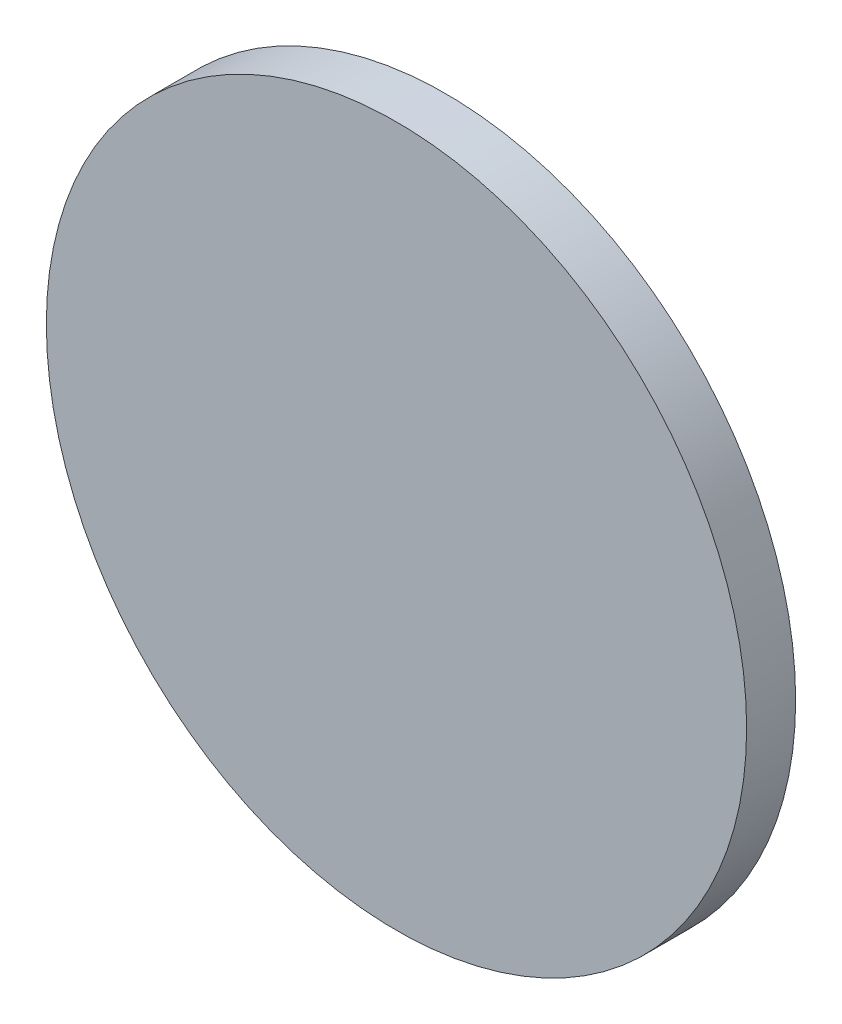
ISO-10303-21;
HEADER;
FILE_DESCRIPTION(('STEP AP214'),'2;1');
FILE_NAME('part.step','',(''),(''),'','','');
FILE_SCHEMA(('AUTOMOTIVE_DESIGN { 1 0 10303 214 1 1 1 1 }'));
ENDSEC;
DATA;
#1=APPLICATION_CONTEXT('core data for automotive mechanical design processes');
#2=APPLICATION_PROTOCOL_DEFINITION('international standard','automotive_design',2000,#1);
#3=PRODUCT_CONTEXT('',#1,'mechanical');
#4=PRODUCT('Part','Part','',(#3));
#5=PRODUCT_RELATED_PRODUCT_CATEGORY('part','',(#4));
#6=PRODUCT_DEFINITION_FORMATION('','',#4);
#7=PRODUCT_DEFINITION_CONTEXT('part definition',#1,'design');
#8=PRODUCT_DEFINITION('design','',#6,#7);
#9=PRODUCT_DEFINITION_SHAPE('','',#8);
#10=(LENGTH_UNIT() NAMED_UNIT(*) SI_UNIT(.MILLI.,.METRE.));
#11=(NAMED_UNIT(*) PLANE_ANGLE_UNIT() SI_UNIT($,.RADIAN.));
#12=(NAMED_UNIT(*) SI_UNIT($,.STERADIAN.) SOLID_ANGLE_UNIT());
#13=UNCERTAINTY_MEASURE_WITH_UNIT(LENGTH_MEASURE(1.E-05),#10,'distance_accuracy_value','');
#14=(GEOMETRIC_REPRESENTATION_CONTEXT(3) GLOBAL_UNCERTAINTY_ASSIGNED_CONTEXT((#13)) GLOBAL_UNIT_ASSIGNED_CONTEXT((#10,
#11,#12)) REPRESENTATION_CONTEXT('',''));
#15=CARTESIAN_POINT('',(0.,0.,0.));
#16=DIRECTION('',(0.,0.,1.));
#17=DIRECTION('',(1.,0.,0.));
#18=AXIS2_PLACEMENT_3D('',#15,#16,#17);
#19=CARTESIAN_POINT('',(142.,0.,7.));
#20=DIRECTION('',(0.,0.,-1.));
#21=DIRECTION('',(-1.,0.,0.));
#22=AXIS2_PLACEMENT_3D('',#19,#20,#21);
#23=CYLINDRICAL_SURFACE('',#22,50.);
#24=CARTESIAN_POINT('',(142.,0.,7.));
#25=DIRECTION('',(0.,0.,1.));
#26=DIRECTION('',(1.,0.,0.));
#27=AXIS2_PLACEMENT_3D('',#24,#25,#26);
#28=CIRCLE('',#27,50.);
#29=CARTESIAN_POINT('',(192.,0.,7.));
#30=VERTEX_POINT('',#29);
#31=EDGE_CURVE('E10',#30,#30,#28,.T.);
#32=ORIENTED_EDGE('',*,*,#31,.F.);
#33=EDGE_LOOP('',(#32));
#34=FACE_BOUND('',#33,.T.);
#35=CARTESIAN_POINT('',(142.,0.,0.));
#36=DIRECTION('',(0.,0.,1.));
#37=DIRECTION('',(1.,0.,0.));
#38=AXIS2_PLACEMENT_3D('',#35,#36,#37);
#39=CIRCLE('',#38,50.);
#40=CARTESIAN_POINT('',(192.,0.,0.));
#41=VERTEX_POINT('',#40);
#42=EDGE_CURVE('E37',#41,#41,#39,.T.);
#43=ORIENTED_EDGE('',*,*,#42,.T.);
#44=EDGE_LOOP('',(#43));
#45=FACE_BOUND('',#44,.T.);
#46=ADVANCED_FACE('F31',(#34,#45),#23,.T.);
#47=CARTESIAN_POINT('',(142.,0.,7.));
#48=DIRECTION('',(0.,0.,1.));
#49=DIRECTION('',(1.,0.,0.));
#50=AXIS2_PLACEMENT_3D('',#47,#48,#49);
#51=PLANE('',#50);
#52=ORIENTED_EDGE('',*,*,#31,.T.);
#53=EDGE_LOOP('',(#52));
#54=FACE_BOUND('',#53,.T.);
#55=ADVANCED_FACE('F46',(#54),#51,.T.);
#56=CARTESIAN_POINT('',(142.,0.,0.));
#57=DIRECTION('',(0.,0.,1.));
#58=DIRECTION('',(1.,0.,0.));
#59=AXIS2_PLACEMENT_3D('',#56,#57,#58);
#60=PLANE('',#59);
#61=ORIENTED_EDGE('',*,*,#42,.F.);
#62=EDGE_LOOP('',(#61));
#63=FACE_BOUND('',#62,.T.);
#64=ADVANCED_FACE('F44',(#63),#60,.F.);
#65=CLOSED_SHELL('',(#46,#55,#64));
#66=MANIFOLD_SOLID_BREP('B2',#65);
#67=ADVANCED_BREP_SHAPE_REPRESENTATION('',(#18,#66),#14);
#68=SHAPE_DEFINITION_REPRESENTATION(#9,#67);
ENDSEC;
END-ISO-10303-21;
